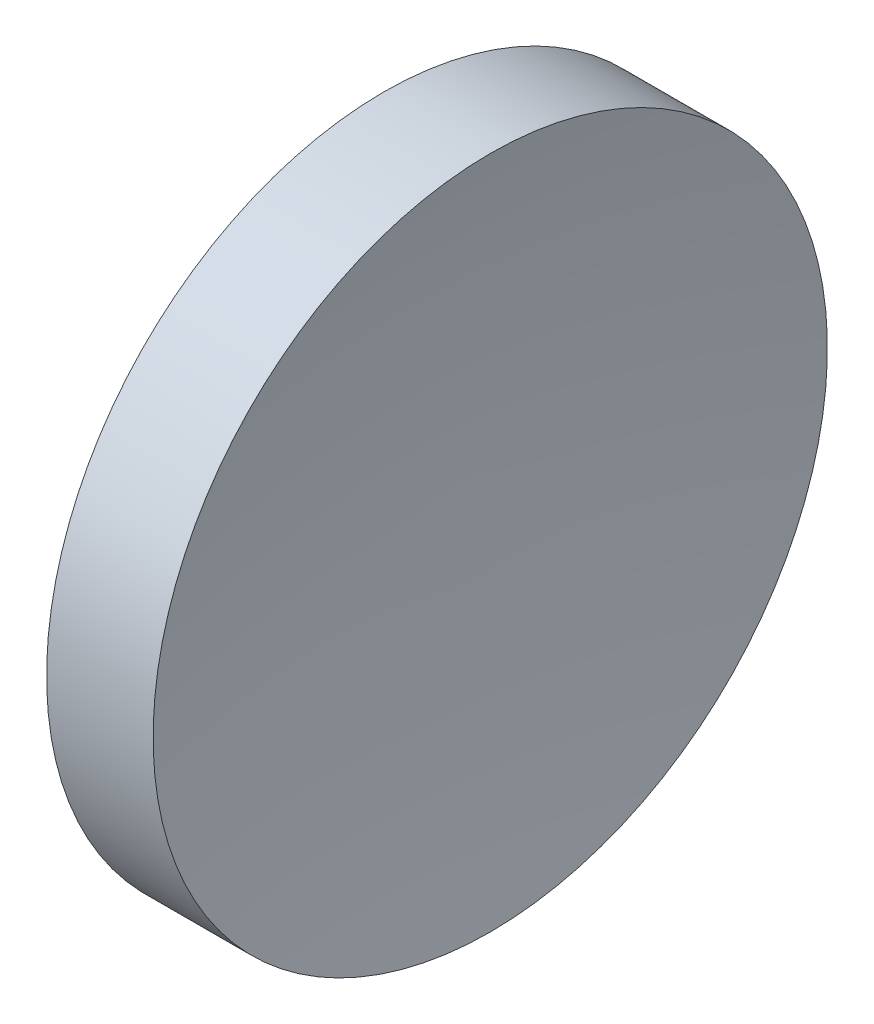
ISO-10303-21;
HEADER;
FILE_DESCRIPTION(('STEP AP214'),'2;1');
FILE_NAME('part.step','',(''),(''),'','','');
FILE_SCHEMA(('AUTOMOTIVE_DESIGN { 1 0 10303 214 1 1 1 1 }'));
ENDSEC;
DATA;
#1=APPLICATION_CONTEXT('core data for automotive mechanical design processes');
#2=APPLICATION_PROTOCOL_DEFINITION('international standard','automotive_design',2000,#1);
#3=PRODUCT_CONTEXT('',#1,'mechanical');
#4=PRODUCT('Part','Part','',(#3));
#5=PRODUCT_RELATED_PRODUCT_CATEGORY('part','',(#4));
#6=PRODUCT_DEFINITION_FORMATION('','',#4);
#7=PRODUCT_DEFINITION_CONTEXT('part definition',#1,'design');
#8=PRODUCT_DEFINITION('design','',#6,#7);
#9=PRODUCT_DEFINITION_SHAPE('','',#8);
#10=(LENGTH_UNIT() NAMED_UNIT(*) SI_UNIT(.MILLI.,.METRE.));
#11=(NAMED_UNIT(*) PLANE_ANGLE_UNIT() SI_UNIT($,.RADIAN.));
#12=(NAMED_UNIT(*) SI_UNIT($,.STERADIAN.) SOLID_ANGLE_UNIT());
#13=UNCERTAINTY_MEASURE_WITH_UNIT(LENGTH_MEASURE(1.E-05),#10,'distance_accuracy_value','');
#14=(GEOMETRIC_REPRESENTATION_CONTEXT(3) GLOBAL_UNCERTAINTY_ASSIGNED_CONTEXT((#13)) GLOBAL_UNIT_ASSIGNED_CONTEXT((#10,
#11,#12)) REPRESENTATION_CONTEXT('',''));
#15=CARTESIAN_POINT('',(0.,0.,0.));
#16=DIRECTION('',(0.,0.,1.));
#17=DIRECTION('',(1.,0.,0.));
#18=AXIS2_PLACEMENT_3D('',#15,#16,#17);
#19=CARTESIAN_POINT('',(168.887034996249,51.4784275449049,0.));
#20=DIRECTION('',(0.,0.,-1.));
#21=DIRECTION('',(0.,-1.,0.));
#22=AXIS2_PLACEMENT_3D('',#19,#20,#21);
#23=CIRCLE('',#22,71.8);
#24=TRIMMED_CURVE('',#23,(PARAMETER_VALUE(-1.58054097619043)),
(PARAMETER_VALUE(1.58054097619043)),.T.,.PARAMETER.);
#25=CARTESIAN_POINT('',(168.887034996249,52.17808229839,0.));
#26=DIRECTION('',(-1.,0.,0.));
#27=AXIS1_PLACEMENT('',#25,#26);
#28=SURFACE_OF_REVOLUTION('',#24,#27);
#29=CARTESIAN_POINT('',(98.096981217738,52.1780822983899,0.));
#30=DIRECTION('',(-1.,0.,0.));
#31=DIRECTION('',(0.,-1.,0.));
#32=AXIS2_PLACEMENT_3D('',#29,#30,#31);
#33=CIRCLE('',#32,12.7);
#34=CARTESIAN_POINT('',(98.096981217738,39.4780822983899,0.));
#35=VERTEX_POINT('',#34);
#36=EDGE_CURVE('E11',#35,#35,#33,.T.);
#37=ORIENTED_EDGE('',*,*,#36,.F.);
#38=EDGE_LOOP('',(#37));
#39=FACE_BOUND('',#38,.T.);
#40=CARTESIAN_POINT('',(97.09044396836,52.1780822983899,0.));
#41=VERTEX_POINT('',#40);
#42=VERTEX_LOOP('',#41);
#43=FACE_BOUND('',#42,.T.);
#44=ADVANCED_FACE('F37',(#39,#43),#28,.F.);
#45=CARTESIAN_POINT('',(89.8586564536171,52.1780822983899,0.));
#46=DIRECTION('',(-1.,0.,0.));
#47=DIRECTION('',(0.,-1.,0.));
#48=AXIS2_PLACEMENT_3D('',#45,#46,#47);
#49=CYLINDRICAL_SURFACE('',#48,12.7);
#50=CARTESIAN_POINT('',(94.0839067189819,52.1780822983899,0.));
#51=DIRECTION('',(-1.,0.,0.));
#52=DIRECTION('',(0.,-1.,0.));
#53=AXIS2_PLACEMENT_3D('',#50,#51,#52);
#54=CIRCLE('',#53,12.7);
#55=CARTESIAN_POINT('',(94.0839067189819,39.4780822983899,0.));
#56=VERTEX_POINT('',#55);
#57=EDGE_CURVE('E44',#56,#56,#54,.T.);
#58=ORIENTED_EDGE('',*,*,#57,.F.);
#59=EDGE_LOOP('',(#58));
#60=FACE_BOUND('',#59,.T.);
#61=ORIENTED_EDGE('',*,*,#36,.T.);
#62=EDGE_LOOP('',(#61));
#63=FACE_BOUND('',#62,.T.);
#64=ADVANCED_FACE('F53',(#60,#63),#49,.T.);
#65=CARTESIAN_POINT('',(23.2938529404711,51.4784275449048,0.));
#66=DIRECTION('',(0.,0.,-1.));
#67=DIRECTION('',(0.,-1.,0.));
#68=AXIS2_PLACEMENT_3D('',#65,#66,#67);
#69=CIRCLE('',#68,71.8);
#70=TRIMMED_CURVE('',#69,(PARAMETER_VALUE(-1.58054097619043)),
(PARAMETER_VALUE(1.58054097619043)),.T.,.PARAMETER.);
#71=CARTESIAN_POINT('',(23.2938529404711,52.1780822983899,0.));
#72=DIRECTION('',(-1.,0.,0.));
#73=AXIS1_PLACEMENT('',#71,#72);
#74=SURFACE_OF_REVOLUTION('',#70,#73);
#75=CARTESIAN_POINT('',(95.09044396836,52.1780822983899,0.));
#76=VERTEX_POINT('',#75);
#77=VERTEX_LOOP('',#76);
#78=FACE_BOUND('',#77,.T.);
#79=ORIENTED_EDGE('',*,*,#57,.T.);
#80=EDGE_LOOP('',(#79));
#81=FACE_BOUND('',#80,.T.);
#82=ADVANCED_FACE('F50',(#78,#81),#74,.F.);
#83=CLOSED_SHELL('',(#44,#64,#82));
#84=MANIFOLD_SOLID_BREP('B2',#83);
#85=ADVANCED_BREP_SHAPE_REPRESENTATION('',(#18,#84),#14);
#86=SHAPE_DEFINITION_REPRESENTATION(#9,#85);
ENDSEC;
END-ISO-10303-21;
